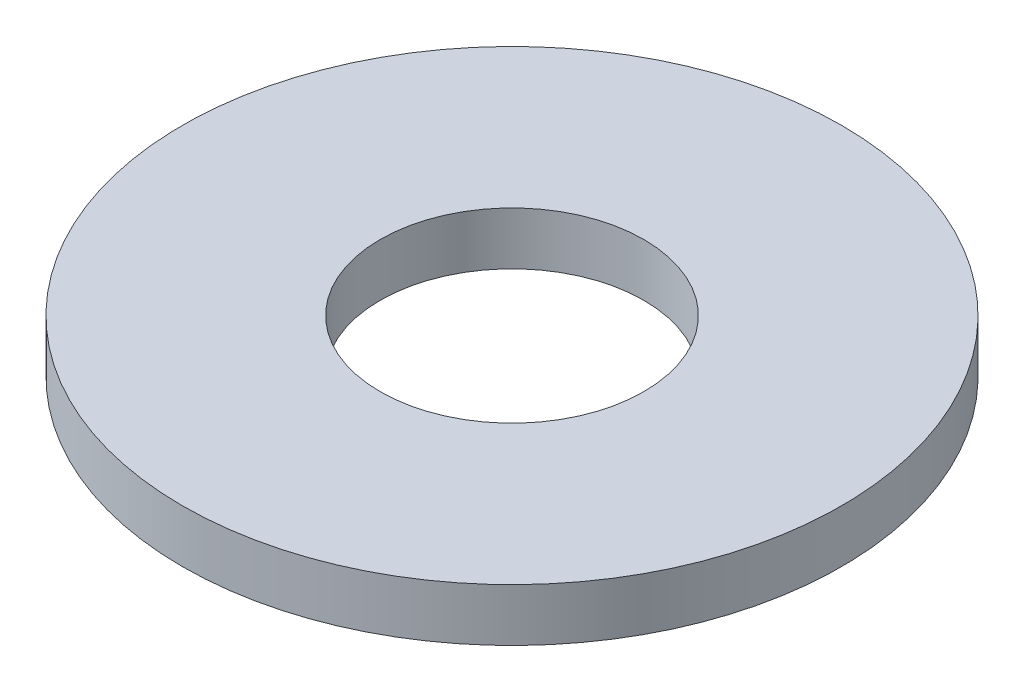
ISO-10303-21;
HEADER;
FILE_DESCRIPTION(('STEP AP214'),'2;1');
FILE_NAME('part.step','',(''),(''),'','','');
FILE_SCHEMA(('AUTOMOTIVE_DESIGN { 1 0 10303 214 1 1 1 1 }'));
ENDSEC;
DATA;
#1=APPLICATION_CONTEXT('core data for automotive mechanical design processes');
#2=APPLICATION_PROTOCOL_DEFINITION('international standard','automotive_design',2000,#1);
#3=PRODUCT_CONTEXT('',#1,'mechanical');
#4=PRODUCT('Part','Part','',(#3));
#5=PRODUCT_RELATED_PRODUCT_CATEGORY('part','',(#4));
#6=PRODUCT_DEFINITION_FORMATION('','',#4);
#7=PRODUCT_DEFINITION_CONTEXT('part definition',#1,'design');
#8=PRODUCT_DEFINITION('design','',#6,#7);
#9=PRODUCT_DEFINITION_SHAPE('','',#8);
#10=(LENGTH_UNIT() NAMED_UNIT(*) SI_UNIT(.MILLI.,.METRE.));
#11=(NAMED_UNIT(*) PLANE_ANGLE_UNIT() SI_UNIT($,.RADIAN.));
#12=(NAMED_UNIT(*) SI_UNIT($,.STERADIAN.) SOLID_ANGLE_UNIT());
#13=UNCERTAINTY_MEASURE_WITH_UNIT(LENGTH_MEASURE(1.E-05),#10,'distance_accuracy_value','');
#14=(GEOMETRIC_REPRESENTATION_CONTEXT(3) GLOBAL_UNCERTAINTY_ASSIGNED_CONTEXT((#13)) GLOBAL_UNIT_ASSIGNED_CONTEXT((#10,
#11,#12)) REPRESENTATION_CONTEXT('',''));
#15=CARTESIAN_POINT('',(0.,0.,0.));
#16=DIRECTION('',(0.,0.,1.));
#17=DIRECTION('',(1.,0.,0.));
#18=AXIS2_PLACEMENT_3D('',#15,#16,#17);
#19=CARTESIAN_POINT('',(0.,6.,0.));
#20=DIRECTION('',(0.,-1.,0.));
#21=DIRECTION('',(0.,0.,-1.));
#22=AXIS2_PLACEMENT_3D('',#19,#20,#21);
#23=CYLINDRICAL_SURFACE('',#22,37.5);
#24=CARTESIAN_POINT('',(0.,6.,0.));
#25=DIRECTION('',(0.,1.,0.));
#26=DIRECTION('',(0.,0.,1.));
#27=AXIS2_PLACEMENT_3D('',#24,#25,#26);
#28=CIRCLE('',#27,37.5);
#29=CARTESIAN_POINT('',(0.,6.,37.5));
#30=VERTEX_POINT('',#29);
#31=EDGE_CURVE('E10',#30,#30,#28,.T.);
#32=ORIENTED_EDGE('',*,*,#31,.F.);
#33=EDGE_LOOP('',(#32));
#34=FACE_BOUND('',#33,.T.);
#35=CARTESIAN_POINT('',(0.,0.,0.));
#36=DIRECTION('',(0.,1.,0.));
#37=DIRECTION('',(0.,0.,1.));
#38=AXIS2_PLACEMENT_3D('',#35,#36,#37);
#39=CIRCLE('',#38,37.5);
#40=CARTESIAN_POINT('',(0.,0.,37.5));
#41=VERTEX_POINT('',#40);
#42=EDGE_CURVE('E37',#41,#41,#39,.T.);
#43=ORIENTED_EDGE('',*,*,#42,.T.);
#44=EDGE_LOOP('',(#43));
#45=FACE_BOUND('',#44,.T.);
#46=ADVANCED_FACE('F40',(#34,#45),#23,.T.);
#47=CARTESIAN_POINT('',(0.,6.,0.));
#48=DIRECTION('',(0.,1.,0.));
#49=DIRECTION('',(0.,0.,1.));
#50=AXIS2_PLACEMENT_3D('',#47,#48,#49);
#51=PLANE('',#50);
#52=CARTESIAN_POINT('',(0.,6.,0.));
#53=DIRECTION('',(0.,1.,0.));
#54=DIRECTION('',(0.,0.,1.));
#55=AXIS2_PLACEMENT_3D('',#52,#53,#54);
#56=CIRCLE('',#55,15.);
#57=CARTESIAN_POINT('',(0.,6.,15.));
#58=VERTEX_POINT('',#57);
#59=EDGE_CURVE('E50',#58,#58,#56,.T.);
#60=ORIENTED_EDGE('',*,*,#59,.F.);
#61=EDGE_LOOP('',(#60));
#62=FACE_BOUND('',#61,.T.);
#63=ORIENTED_EDGE('',*,*,#31,.T.);
#64=EDGE_LOOP('',(#63));
#65=FACE_BOUND('',#64,.T.);
#66=ADVANCED_FACE('F59',(#62,#65),#51,.T.);
#67=CARTESIAN_POINT('',(0.,0.,0.));
#68=DIRECTION('',(0.,1.,0.));
#69=DIRECTION('',(0.,0.,1.));
#70=AXIS2_PLACEMENT_3D('',#67,#68,#69);
#71=PLANE('',#70);
#72=CARTESIAN_POINT('',(0.,0.,0.));
#73=DIRECTION('',(0.,1.,0.));
#74=DIRECTION('',(0.,0.,1.));
#75=AXIS2_PLACEMENT_3D('',#72,#73,#74);
#76=CIRCLE('',#75,15.);
#77=CARTESIAN_POINT('',(0.,0.,15.));
#78=VERTEX_POINT('',#77);
#79=EDGE_CURVE('E47',#78,#78,#76,.T.);
#80=ORIENTED_EDGE('',*,*,#79,.T.);
#81=EDGE_LOOP('',(#80));
#82=FACE_BOUND('',#81,.T.);
#83=ORIENTED_EDGE('',*,*,#42,.F.);
#84=EDGE_LOOP('',(#83));
#85=FACE_BOUND('',#84,.T.);
#86=ADVANCED_FACE('F58',(#82,#85),#71,.F.);
#87=CARTESIAN_POINT('',(0.,6.,0.));
#88=DIRECTION('',(0.,-1.,0.));
#89=DIRECTION('',(0.,0.,-1.));
#90=AXIS2_PLACEMENT_3D('',#87,#88,#89);
#91=CYLINDRICAL_SURFACE('',#90,15.);
#92=ORIENTED_EDGE('',*,*,#59,.T.);
#93=EDGE_LOOP('',(#92));
#94=FACE_BOUND('',#93,.T.);
#95=ORIENTED_EDGE('',*,*,#79,.F.);
#96=EDGE_LOOP('',(#95));
#97=FACE_BOUND('',#96,.T.);
#98=ADVANCED_FACE('F54',(#94,#97),#91,.F.);
#99=CLOSED_SHELL('',(#46,#66,#86,#98));
#100=MANIFOLD_SOLID_BREP('B2',#99);
#101=ADVANCED_BREP_SHAPE_REPRESENTATION('',(#18,#100),#14);
#102=SHAPE_DEFINITION_REPRESENTATION(#9,#101);
ENDSEC;
END-ISO-10303-21;
